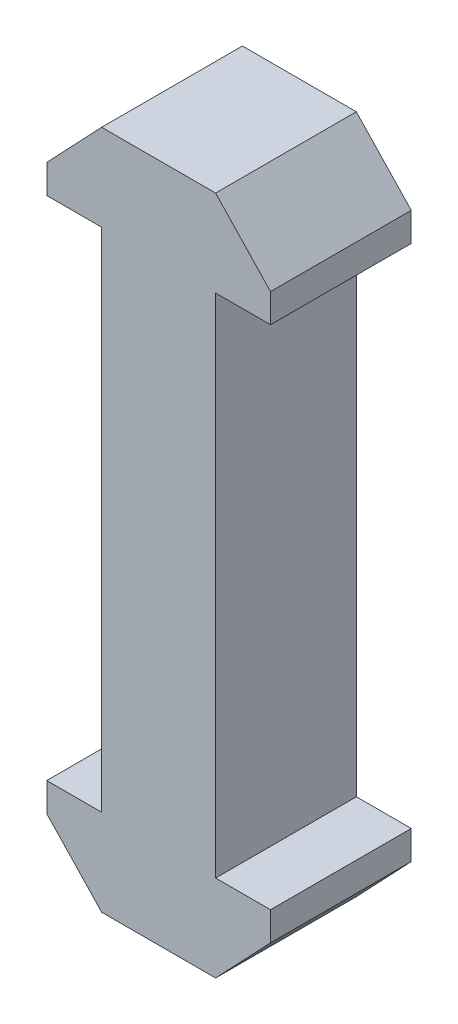
ISO-10303-21;
HEADER;
FILE_DESCRIPTION(('STEP AP214'),'2;1');
FILE_NAME('part.step','',(''),(''),'','','');
FILE_SCHEMA(('AUTOMOTIVE_DESIGN { 1 0 10303 214 1 1 1 1 }'));
ENDSEC;
DATA;
#1=APPLICATION_CONTEXT('core data for automotive mechanical design processes');
#2=APPLICATION_PROTOCOL_DEFINITION('international standard','automotive_design',2000,#1);
#3=PRODUCT_CONTEXT('',#1,'mechanical');
#4=PRODUCT('Part','Part','',(#3));
#5=PRODUCT_RELATED_PRODUCT_CATEGORY('part','',(#4));
#6=PRODUCT_DEFINITION_FORMATION('','',#4);
#7=PRODUCT_DEFINITION_CONTEXT('part definition',#1,'design');
#8=PRODUCT_DEFINITION('design','',#6,#7);
#9=PRODUCT_DEFINITION_SHAPE('','',#8);
#10=(LENGTH_UNIT() NAMED_UNIT(*) SI_UNIT(.MILLI.,.METRE.));
#11=(NAMED_UNIT(*) PLANE_ANGLE_UNIT() SI_UNIT($,.RADIAN.));
#12=(NAMED_UNIT(*) SI_UNIT($,.STERADIAN.) SOLID_ANGLE_UNIT());
#13=UNCERTAINTY_MEASURE_WITH_UNIT(LENGTH_MEASURE(1.E-05),#10,'distance_accuracy_value','');
#14=(GEOMETRIC_REPRESENTATION_CONTEXT(3) GLOBAL_UNCERTAINTY_ASSIGNED_CONTEXT((#13)) GLOBAL_UNIT_ASSIGNED_CONTEXT((#10,
#11,#12)) REPRESENTATION_CONTEXT('',''));
#15=CARTESIAN_POINT('',(0.,0.,0.));
#16=DIRECTION('',(0.,0.,1.));
#17=DIRECTION('',(1.,0.,0.));
#18=AXIS2_PLACEMENT_3D('',#15,#16,#17);
#19=CARTESIAN_POINT('',(-7.95,0.,5.));
#20=DIRECTION('',(-1.,0.,0.));
#21=DIRECTION('',(0.,-1.,0.));
#22=AXIS2_PLACEMENT_3D('',#19,#20,#21);
#23=PLANE('',#22);
#24=DIRECTION('',(0.,1.,0.));
#25=VECTOR('',#24,1.);
#26=CARTESIAN_POINT('',(-7.95,0.,-5.));
#27=LINE('',#26,#25);
#28=CARTESIAN_POINT('',(-7.95,-2.04,-5.));
#29=VERTEX_POINT('',#28);
#30=CARTESIAN_POINT('',(-7.95,0.,-5.));
#31=VERTEX_POINT('',#30);
#32=EDGE_CURVE('E183',#29,#31,#27,.T.);
#33=ORIENTED_EDGE('',*,*,#32,.F.);
#34=DIRECTION('',(0.,0.,-1.));
#35=VECTOR('',#34,1.);
#36=CARTESIAN_POINT('',(-7.95,-2.04,5.));
#37=LINE('',#36,#35);
#38=CARTESIAN_POINT('',(-7.95,-2.04,5.));
#39=VERTEX_POINT('',#38);
#40=EDGE_CURVE('E11',#39,#29,#37,.T.);
#41=ORIENTED_EDGE('',*,*,#40,.F.);
#42=DIRECTION('',(0.,1.,0.));
#43=VECTOR('',#42,1.);
#44=CARTESIAN_POINT('',(-7.95,0.,5.));
#45=LINE('',#44,#43);
#46=CARTESIAN_POINT('',(-7.95,0.,5.));
#47=VERTEX_POINT('',#46);
#48=EDGE_CURVE('E271',#39,#47,#45,.T.);
#49=ORIENTED_EDGE('',*,*,#48,.T.);
#50=DIRECTION('',(0.,0.,-1.));
#51=VECTOR('',#50,1.);
#52=CARTESIAN_POINT('',(-7.95,0.,5.));
#53=LINE('',#52,#51);
#54=EDGE_CURVE('E55',#47,#31,#53,.T.);
#55=ORIENTED_EDGE('',*,*,#54,.T.);
#56=EDGE_LOOP('',(#33,#41,#49,#55));
#57=FACE_BOUND('',#56,.T.);
#58=ADVANCED_FACE('F39',(#57),#23,.T.);
#59=CARTESIAN_POINT('',(-5.20217481392665,-4.93600140143796,5.));
#60=DIRECTION('',(-0.725421588273713,-0.688304815664138,0.));
#61=DIRECTION('',(0.688304815664138,-0.725421588273713,0.));
#62=AXIS2_PLACEMENT_3D('',#59,#60,#61);
#63=PLANE('',#62);
#64=DIRECTION('',(-0.688304815664138,0.725421588273713,0.));
#65=VECTOR('',#64,1.);
#66=CARTESIAN_POINT('',(-5.20217481392665,-4.93600140143796,-5.));
#67=LINE('',#66,#65);
#68=CARTESIAN_POINT('',(-4.048,-6.15241498392368,-5.));
#69=VERTEX_POINT('',#68);
#70=EDGE_CURVE('E185',#69,#29,#67,.T.);
#71=ORIENTED_EDGE('',*,*,#70,.F.);
#72=DIRECTION('',(0.,0.,-1.));
#73=VECTOR('',#72,1.);
#74=CARTESIAN_POINT('',(-4.048,-6.15241498392368,5.));
#75=LINE('',#74,#73);
#76=CARTESIAN_POINT('',(-4.048,-6.15241498392368,5.));
#77=VERTEX_POINT('',#76);
#78=EDGE_CURVE('E47',#77,#69,#75,.T.);
#79=ORIENTED_EDGE('',*,*,#78,.F.);
#80=DIRECTION('',(-0.688304815664138,0.725421588273713,0.));
#81=VECTOR('',#80,1.);
#82=CARTESIAN_POINT('',(-5.20217481392665,-4.93600140143796,5.));
#83=LINE('',#82,#81);
#84=EDGE_CURVE('E267',#77,#39,#83,.T.);
#85=ORIENTED_EDGE('',*,*,#84,.T.);
#86=ORIENTED_EDGE('',*,*,#40,.T.);
#87=EDGE_LOOP('',(#71,#79,#85,#86));
#88=FACE_BOUND('',#87,.T.);
#89=ADVANCED_FACE('F255',(#88),#63,.T.);
#90=CARTESIAN_POINT('',(0.,-6.15241498392368,5.));
#91=DIRECTION('',(0.,-1.,0.));
#92=DIRECTION('',(1.,0.,0.));
#93=AXIS2_PLACEMENT_3D('',#90,#91,#92);
#94=PLANE('',#93);
#95=DIRECTION('',(-1.,0.,0.));
#96=VECTOR('',#95,1.);
#97=CARTESIAN_POINT('',(0.,-6.15241498392368,-5.));
#98=LINE('',#97,#96);
#99=CARTESIAN_POINT('',(4.048,-6.15241498392368,-5.));
#100=VERTEX_POINT('',#99);
#101=EDGE_CURVE('E188',#100,#69,#98,.T.);
#102=ORIENTED_EDGE('',*,*,#101,.F.);
#103=DIRECTION('',(0.,0.,-1.));
#104=VECTOR('',#103,1.);
#105=CARTESIAN_POINT('',(4.048,-6.15241498392368,5.));
#106=LINE('',#105,#104);
#107=CARTESIAN_POINT('',(4.048,-6.15241498392368,5.));
#108=VERTEX_POINT('',#107);
#109=EDGE_CURVE('E244',#108,#100,#106,.T.);
#110=ORIENTED_EDGE('',*,*,#109,.F.);
#111=DIRECTION('',(-1.,0.,0.));
#112=VECTOR('',#111,1.);
#113=CARTESIAN_POINT('',(0.,-6.15241498392368,5.));
#114=LINE('',#113,#112);
#115=EDGE_CURVE('E251',#108,#77,#114,.T.);
#116=ORIENTED_EDGE('',*,*,#115,.T.);
#117=ORIENTED_EDGE('',*,*,#78,.T.);
#118=EDGE_LOOP('',(#102,#110,#116,#117));
#119=FACE_BOUND('',#118,.T.);
#120=ADVANCED_FACE('F249',(#119),#94,.T.);
#121=CARTESIAN_POINT('',(5.20217481392665,-4.93600140143796,5.));
#122=DIRECTION('',(0.725421588273714,-0.688304815664138,0.));
#123=DIRECTION('',(0.688304815664138,0.725421588273714,0.));
#124=AXIS2_PLACEMENT_3D('',#121,#122,#123);
#125=PLANE('',#124);
#126=DIRECTION('',(-0.688304815664138,-0.725421588273714,0.));
#127=VECTOR('',#126,1.);
#128=CARTESIAN_POINT('',(5.20217481392665,-4.93600140143796,-5.));
#129=LINE('',#128,#127);
#130=CARTESIAN_POINT('',(7.95,-2.04,-5.));
#131=VERTEX_POINT('',#130);
#132=EDGE_CURVE('E191',#131,#100,#129,.T.);
#133=ORIENTED_EDGE('',*,*,#132,.F.);
#134=DIRECTION('',(0.,0.,-1.));
#135=VECTOR('',#134,1.);
#136=CARTESIAN_POINT('',(7.95,-2.04,5.));
#137=LINE('',#136,#135);
#138=CARTESIAN_POINT('',(7.95,-2.04,5.));
#139=VERTEX_POINT('',#138);
#140=EDGE_CURVE('E242',#139,#131,#137,.T.);
#141=ORIENTED_EDGE('',*,*,#140,.F.);
#142=DIRECTION('',(-0.688304815664138,-0.725421588273714,0.));
#143=VECTOR('',#142,1.);
#144=CARTESIAN_POINT('',(5.20217481392665,-4.93600140143796,5.));
#145=LINE('',#144,#143);
#146=EDGE_CURVE('E264',#139,#108,#145,.T.);
#147=ORIENTED_EDGE('',*,*,#146,.T.);
#148=ORIENTED_EDGE('',*,*,#109,.T.);
#149=EDGE_LOOP('',(#133,#141,#147,#148));
#150=FACE_BOUND('',#149,.T.);
#151=ADVANCED_FACE('F261',(#150),#125,.T.);
#152=CARTESIAN_POINT('',(7.95,0.,5.));
#153=DIRECTION('',(1.,0.,0.));
#154=DIRECTION('',(0.,1.,0.));
#155=AXIS2_PLACEMENT_3D('',#152,#153,#154);
#156=PLANE('',#155);
#157=DIRECTION('',(0.,-1.,0.));
#158=VECTOR('',#157,1.);
#159=CARTESIAN_POINT('',(7.95,0.,-5.));
#160=LINE('',#159,#158);
#161=CARTESIAN_POINT('',(7.95,0.,-5.));
#162=VERTEX_POINT('',#161);
#163=EDGE_CURVE('E194',#162,#131,#160,.T.);
#164=ORIENTED_EDGE('',*,*,#163,.F.);
#165=DIRECTION('',(0.,0.,-1.));
#166=VECTOR('',#165,1.);
#167=CARTESIAN_POINT('',(7.95,0.,5.));
#168=LINE('',#167,#166);
#169=CARTESIAN_POINT('',(7.95,0.,5.));
#170=VERTEX_POINT('',#169);
#171=EDGE_CURVE('E240',#170,#162,#168,.T.);
#172=ORIENTED_EDGE('',*,*,#171,.F.);
#173=DIRECTION('',(0.,-1.,0.));
#174=VECTOR('',#173,1.);
#175=CARTESIAN_POINT('',(7.95,0.,5.));
#176=LINE('',#175,#174);
#177=EDGE_CURVE('E269',#170,#139,#176,.T.);
#178=ORIENTED_EDGE('',*,*,#177,.T.);
#179=ORIENTED_EDGE('',*,*,#140,.T.);
#180=EDGE_LOOP('',(#164,#172,#178,#179));
#181=FACE_BOUND('',#180,.T.);
#182=ADVANCED_FACE('F309',(#181),#156,.T.);
#183=CARTESIAN_POINT('',(0.,0.,5.));
#184=DIRECTION('',(0.,1.,0.));
#185=DIRECTION('',(-1.,0.,0.));
#186=AXIS2_PLACEMENT_3D('',#183,#184,#185);
#187=PLANE('',#186);
#188=DIRECTION('',(1.,0.,0.));
#189=VECTOR('',#188,1.);
#190=CARTESIAN_POINT('',(0.,0.,-5.));
#191=LINE('',#190,#189);
#192=CARTESIAN_POINT('',(4.05,0.,-5.));
#193=VERTEX_POINT('',#192);
#194=EDGE_CURVE('E197',#193,#162,#191,.T.);
#195=ORIENTED_EDGE('',*,*,#194,.F.);
#196=DIRECTION('',(0.,0.,-1.));
#197=VECTOR('',#196,1.);
#198=CARTESIAN_POINT('',(4.05,0.,5.));
#199=LINE('',#198,#197);
#200=CARTESIAN_POINT('',(4.05,0.,5.));
#201=VERTEX_POINT('',#200);
#202=EDGE_CURVE('E238',#201,#193,#199,.T.);
#203=ORIENTED_EDGE('',*,*,#202,.F.);
#204=DIRECTION('',(1.,0.,0.));
#205=VECTOR('',#204,1.);
#206=CARTESIAN_POINT('',(0.,0.,5.));
#207=LINE('',#206,#205);
#208=EDGE_CURVE('E179',#201,#170,#207,.T.);
#209=ORIENTED_EDGE('',*,*,#208,.T.);
#210=ORIENTED_EDGE('',*,*,#171,.T.);
#211=EDGE_LOOP('',(#195,#203,#209,#210));
#212=FACE_BOUND('',#211,.T.);
#213=ADVANCED_FACE('F299',(#212),#187,.T.);
#214=CARTESIAN_POINT('',(4.05,0.,5.));
#215=DIRECTION('',(-1.,0.,0.));
#216=DIRECTION('',(0.,0.,1.));
#217=AXIS2_PLACEMENT_3D('',#214,#215,#216);
#218=PLANE('',#217);
#219=DIRECTION('',(0.,1.,0.));
#220=VECTOR('',#219,1.);
#221=CARTESIAN_POINT('',(4.05,0.,-5.));
#222=LINE('',#221,#220);
#223=CARTESIAN_POINT('',(4.05,36.,-5.));
#224=VERTEX_POINT('',#223);
#225=EDGE_CURVE('E200',#193,#224,#222,.T.);
#226=ORIENTED_EDGE('',*,*,#225,.T.);
#227=DIRECTION('',(0.,0.,-1.));
#228=VECTOR('',#227,1.);
#229=CARTESIAN_POINT('',(4.05,36.,5.));
#230=LINE('',#229,#228);
#231=CARTESIAN_POINT('',(4.05,36.,5.));
#232=VERTEX_POINT('',#231);
#233=EDGE_CURVE('E235',#232,#224,#230,.T.);
#234=ORIENTED_EDGE('',*,*,#233,.F.);
#235=DIRECTION('',(0.,1.,0.));
#236=VECTOR('',#235,1.);
#237=CARTESIAN_POINT('',(4.05,0.,5.));
#238=LINE('',#237,#236);
#239=EDGE_CURVE('E277',#201,#232,#238,.T.);
#240=ORIENTED_EDGE('',*,*,#239,.F.);
#241=ORIENTED_EDGE('',*,*,#202,.T.);
#242=EDGE_LOOP('',(#226,#234,#240,#241));
#243=FACE_BOUND('',#242,.T.);
#244=ADVANCED_FACE('F308',(#243),#218,.F.);
#245=CARTESIAN_POINT('',(0.,36.,5.));
#246=DIRECTION('',(0.,1.,0.));
#247=DIRECTION('',(-1.,0.,0.));
#248=AXIS2_PLACEMENT_3D('',#245,#246,#247);
#249=PLANE('',#248);
#250=DIRECTION('',(1.,0.,0.));
#251=VECTOR('',#250,1.);
#252=CARTESIAN_POINT('',(0.,36.,-5.));
#253=LINE('',#252,#251);
#254=CARTESIAN_POINT('',(7.95,36.,-5.));
#255=VERTEX_POINT('',#254);
#256=EDGE_CURVE('E203',#224,#255,#253,.T.);
#257=ORIENTED_EDGE('',*,*,#256,.T.);
#258=DIRECTION('',(0.,0.,-1.));
#259=VECTOR('',#258,1.);
#260=CARTESIAN_POINT('',(7.95,36.,5.));
#261=LINE('',#260,#259);
#262=CARTESIAN_POINT('',(7.95,36.,5.));
#263=VERTEX_POINT('',#262);
#264=EDGE_CURVE('E232',#263,#255,#261,.T.);
#265=ORIENTED_EDGE('',*,*,#264,.F.);
#266=DIRECTION('',(1.,0.,0.));
#267=VECTOR('',#266,1.);
#268=CARTESIAN_POINT('',(0.,36.,5.));
#269=LINE('',#268,#267);
#270=EDGE_CURVE('E165',#232,#263,#269,.T.);
#271=ORIENTED_EDGE('',*,*,#270,.F.);
#272=ORIENTED_EDGE('',*,*,#233,.T.);
#273=EDGE_LOOP('',(#257,#265,#271,#272));
#274=FACE_BOUND('',#273,.T.);
#275=ADVANCED_FACE('F327',(#274),#249,.F.);
#276=CARTESIAN_POINT('',(7.95000000000006,0.,5.));
#277=DIRECTION('',(-1.,0.,0.));
#278=DIRECTION('',(0.,-1.,0.));
#279=AXIS2_PLACEMENT_3D('',#276,#277,#278);
#280=PLANE('',#279);
#281=DIRECTION('',(0.,1.,0.));
#282=VECTOR('',#281,1.);
#283=CARTESIAN_POINT('',(7.95000000000006,0.,-5.));
#284=LINE('',#283,#282);
#285=CARTESIAN_POINT('',(7.95,38.04,-5.));
#286=VERTEX_POINT('',#285);
#287=EDGE_CURVE('E205',#255,#286,#284,.T.);
#288=ORIENTED_EDGE('',*,*,#287,.T.);
#289=DIRECTION('',(0.,0.,-1.));
#290=VECTOR('',#289,1.);
#291=CARTESIAN_POINT('',(7.95,38.04,5.));
#292=LINE('',#291,#290);
#293=CARTESIAN_POINT('',(7.95,38.04,5.));
#294=VERTEX_POINT('',#293);
#295=EDGE_CURVE('E229',#294,#286,#292,.T.);
#296=ORIENTED_EDGE('',*,*,#295,.F.);
#297=DIRECTION('',(0.,1.,0.));
#298=VECTOR('',#297,1.);
#299=CARTESIAN_POINT('',(7.95000000000006,0.,5.));
#300=LINE('',#299,#298);
#301=EDGE_CURVE('E279',#263,#294,#300,.T.);
#302=ORIENTED_EDGE('',*,*,#301,.F.);
#303=ORIENTED_EDGE('',*,*,#264,.T.);
#304=EDGE_LOOP('',(#288,#296,#302,#303));
#305=FACE_BOUND('',#304,.T.);
#306=ADVANCED_FACE('F329',(#305),#280,.F.);
#307=CARTESIAN_POINT('',(23.1773770273655,21.99148809503,5.));
#308=DIRECTION('',(-0.725421588273713,-0.688304815664139,0.));
#309=DIRECTION('',(0.688304815664139,-0.725421588273713,0.));
#310=AXIS2_PLACEMENT_3D('',#307,#308,#309);
#311=PLANE('',#310);
#312=DIRECTION('',(-0.688304815664139,0.725421588273713,0.));
#313=VECTOR('',#312,1.);
#314=CARTESIAN_POINT('',(23.1773770273655,21.99148809503,-5.));
#315=LINE('',#314,#313);
#316=CARTESIAN_POINT('',(4.04799999999999,42.1524149839237,-5.));
#317=VERTEX_POINT('',#316);
#318=EDGE_CURVE('E207',#286,#317,#315,.T.);
#319=ORIENTED_EDGE('',*,*,#318,.T.);
#320=DIRECTION('',(0.,0.,-1.));
#321=VECTOR('',#320,1.);
#322=CARTESIAN_POINT('',(4.04799999999999,42.1524149839237,5.));
#323=LINE('',#322,#321);
#324=CARTESIAN_POINT('',(4.04799999999999,42.1524149839237,5.));
#325=VERTEX_POINT('',#324);
#326=EDGE_CURVE('E226',#325,#317,#323,.T.);
#327=ORIENTED_EDGE('',*,*,#326,.F.);
#328=DIRECTION('',(-0.688304815664139,0.725421588273713,0.));
#329=VECTOR('',#328,1.);
#330=CARTESIAN_POINT('',(23.1773770273655,21.99148809503,5.));
#331=LINE('',#330,#329);
#332=EDGE_CURVE('E281',#294,#325,#331,.T.);
#333=ORIENTED_EDGE('',*,*,#332,.F.);
#334=ORIENTED_EDGE('',*,*,#295,.T.);
#335=EDGE_LOOP('',(#319,#327,#333,#334));
#336=FACE_BOUND('',#335,.T.);
#337=ADVANCED_FACE('F332',(#336),#311,.F.);
#338=CARTESIAN_POINT('',(0.,42.1524149839237,5.));
#339=DIRECTION('',(0.,-1.,0.));
#340=DIRECTION('',(1.,0.,0.));
#341=AXIS2_PLACEMENT_3D('',#338,#339,#340);
#342=PLANE('',#341);
#343=DIRECTION('',(-1.,0.,0.));
#344=VECTOR('',#343,1.);
#345=CARTESIAN_POINT('',(0.,42.1524149839237,-5.));
#346=LINE('',#345,#344);
#347=CARTESIAN_POINT('',(-4.04800000000001,42.1524149839237,-5.));
#348=VERTEX_POINT('',#347);
#349=EDGE_CURVE('E209',#317,#348,#346,.T.);
#350=ORIENTED_EDGE('',*,*,#349,.T.);
#351=DIRECTION('',(0.,0.,-1.));
#352=VECTOR('',#351,1.);
#353=CARTESIAN_POINT('',(-4.04800000000001,42.1524149839237,5.));
#354=LINE('',#353,#352);
#355=CARTESIAN_POINT('',(-4.04800000000001,42.1524149839237,5.));
#356=VERTEX_POINT('',#355);
#357=EDGE_CURVE('E223',#356,#348,#354,.T.);
#358=ORIENTED_EDGE('',*,*,#357,.F.);
#359=DIRECTION('',(-1.,0.,0.));
#360=VECTOR('',#359,1.);
#361=CARTESIAN_POINT('',(0.,42.1524149839237,5.));
#362=LINE('',#361,#360);
#363=EDGE_CURVE('E283',#325,#356,#362,.T.);
#364=ORIENTED_EDGE('',*,*,#363,.F.);
#365=ORIENTED_EDGE('',*,*,#326,.T.);
#366=EDGE_LOOP('',(#350,#358,#364,#365));
#367=FACE_BOUND('',#366,.T.);
#368=ADVANCED_FACE('F336',(#367),#342,.F.);
#369=CARTESIAN_POINT('',(-23.1773770273655,21.9914880950299,5.));
#370=DIRECTION('',(0.725421588273714,-0.688304815664137,0.));
#371=DIRECTION('',(0.688304815664137,0.725421588273714,0.));
#372=AXIS2_PLACEMENT_3D('',#369,#370,#371);
#373=PLANE('',#372);
#374=DIRECTION('',(-0.688304815664137,-0.725421588273714,0.));
#375=VECTOR('',#374,1.);
#376=CARTESIAN_POINT('',(-23.1773770273655,21.9914880950299,-5.));
#377=LINE('',#376,#375);
#378=CARTESIAN_POINT('',(-7.95000000000001,38.04,-5.));
#379=VERTEX_POINT('',#378);
#380=EDGE_CURVE('E211',#348,#379,#377,.T.);
#381=ORIENTED_EDGE('',*,*,#380,.T.);
#382=DIRECTION('',(0.,0.,-1.));
#383=VECTOR('',#382,1.);
#384=CARTESIAN_POINT('',(-7.95000000000001,38.04,5.));
#385=LINE('',#384,#383);
#386=CARTESIAN_POINT('',(-7.95000000000001,38.04,5.));
#387=VERTEX_POINT('',#386);
#388=EDGE_CURVE('E220',#387,#379,#385,.T.);
#389=ORIENTED_EDGE('',*,*,#388,.F.);
#390=DIRECTION('',(-0.688304815664137,-0.725421588273714,0.));
#391=VECTOR('',#390,1.);
#392=CARTESIAN_POINT('',(-23.1773770273655,21.9914880950299,5.));
#393=LINE('',#392,#391);
#394=EDGE_CURVE('E284',#356,#387,#393,.T.);
#395=ORIENTED_EDGE('',*,*,#394,.F.);
#396=ORIENTED_EDGE('',*,*,#357,.T.);
#397=EDGE_LOOP('',(#381,#389,#395,#396));
#398=FACE_BOUND('',#397,.T.);
#399=ADVANCED_FACE('F290',(#398),#373,.F.);
#400=CARTESIAN_POINT('',(-7.95,0.,5.));
#401=DIRECTION('',(1.,0.,0.));
#402=DIRECTION('',(0.,0.,-1.));
#403=AXIS2_PLACEMENT_3D('',#400,#401,#402);
#404=PLANE('',#403);
#405=DIRECTION('',(0.,-1.,0.));
#406=VECTOR('',#405,1.);
#407=CARTESIAN_POINT('',(-7.95,0.,-5.));
#408=LINE('',#407,#406);
#409=CARTESIAN_POINT('',(-7.95,36.,-5.));
#410=VERTEX_POINT('',#409);
#411=EDGE_CURVE('E213',#379,#410,#408,.T.);
#412=ORIENTED_EDGE('',*,*,#411,.T.);
#413=DIRECTION('',(0.,0.,-1.));
#414=VECTOR('',#413,1.);
#415=CARTESIAN_POINT('',(-7.95,36.,5.));
#416=LINE('',#415,#414);
#417=CARTESIAN_POINT('',(-7.95,36.,5.));
#418=VERTEX_POINT('',#417);
#419=EDGE_CURVE('E173',#418,#410,#416,.T.);
#420=ORIENTED_EDGE('',*,*,#419,.F.);
#421=DIRECTION('',(0.,-1.,0.));
#422=VECTOR('',#421,1.);
#423=CARTESIAN_POINT('',(-7.95,0.,5.));
#424=LINE('',#423,#422);
#425=EDGE_CURVE('E160',#387,#418,#424,.T.);
#426=ORIENTED_EDGE('',*,*,#425,.F.);
#427=ORIENTED_EDGE('',*,*,#388,.T.);
#428=EDGE_LOOP('',(#412,#420,#426,#427));
#429=FACE_BOUND('',#428,.T.);
#430=ADVANCED_FACE('F294',(#429),#404,.F.);
#431=CARTESIAN_POINT('',(-4.05,36.,-5.));
#432=VERTEX_POINT('',#431);
#433=EDGE_CURVE('E170',#410,#432,#253,.T.);
#434=ORIENTED_EDGE('',*,*,#433,.T.);
#435=DIRECTION('',(0.,0.,-1.));
#436=VECTOR('',#435,1.);
#437=CARTESIAN_POINT('',(-4.05,36.,5.));
#438=LINE('',#437,#436);
#439=CARTESIAN_POINT('',(-4.05,36.,5.));
#440=VERTEX_POINT('',#439);
#441=EDGE_CURVE('E167',#440,#432,#438,.T.);
#442=ORIENTED_EDGE('',*,*,#441,.F.);
#443=EDGE_CURVE('E153',#418,#440,#269,.T.);
#444=ORIENTED_EDGE('',*,*,#443,.F.);
#445=ORIENTED_EDGE('',*,*,#419,.T.);
#446=EDGE_LOOP('',(#434,#442,#444,#445));
#447=FACE_BOUND('',#446,.T.);
#448=ADVANCED_FACE('F168',(#447),#249,.F.);
#449=CARTESIAN_POINT('',(-4.05,0.,5.));
#450=DIRECTION('',(-1.,0.,0.));
#451=DIRECTION('',(0.,0.,1.));
#452=AXIS2_PLACEMENT_3D('',#449,#450,#451);
#453=PLANE('',#452);
#454=DIRECTION('',(0.,1.,0.));
#455=VECTOR('',#454,1.);
#456=CARTESIAN_POINT('',(-4.05,0.,-5.));
#457=LINE('',#456,#455);
#458=CARTESIAN_POINT('',(-4.05,0.,-5.));
#459=VERTEX_POINT('',#458);
#460=EDGE_CURVE('E215',#459,#432,#457,.T.);
#461=ORIENTED_EDGE('',*,*,#460,.F.);
#462=DIRECTION('',(0.,0.,-1.));
#463=VECTOR('',#462,1.);
#464=CARTESIAN_POINT('',(-4.05,0.,5.));
#465=LINE('',#464,#463);
#466=CARTESIAN_POINT('',(-4.05,0.,5.));
#467=VERTEX_POINT('',#466);
#468=EDGE_CURVE('E104',#467,#459,#465,.T.);
#469=ORIENTED_EDGE('',*,*,#468,.F.);
#470=DIRECTION('',(0.,1.,0.));
#471=VECTOR('',#470,1.);
#472=CARTESIAN_POINT('',(-4.05,0.,5.));
#473=LINE('',#472,#471);
#474=EDGE_CURVE('E158',#467,#440,#473,.T.);
#475=ORIENTED_EDGE('',*,*,#474,.T.);
#476=ORIENTED_EDGE('',*,*,#441,.T.);
#477=EDGE_LOOP('',(#461,#469,#475,#476));
#478=FACE_BOUND('',#477,.T.);
#479=ADVANCED_FACE('F175',(#478),#453,.T.);
#480=EDGE_CURVE('E201',#31,#459,#191,.T.);
#481=ORIENTED_EDGE('',*,*,#480,.F.);
#482=ORIENTED_EDGE('',*,*,#54,.F.);
#483=EDGE_CURVE('E176',#47,#467,#207,.T.);
#484=ORIENTED_EDGE('',*,*,#483,.T.);
#485=ORIENTED_EDGE('',*,*,#468,.T.);
#486=EDGE_LOOP('',(#481,#482,#484,#485));
#487=FACE_BOUND('',#486,.T.);
#488=ADVANCED_FACE('F296',(#487),#187,.T.);
#489=CARTESIAN_POINT('',(0.,0.,5.));
#490=DIRECTION('',(0.,0.,1.));
#491=DIRECTION('',(1.,0.,0.));
#492=AXIS2_PLACEMENT_3D('',#489,#490,#491);
#493=PLANE('',#492);
#494=ORIENTED_EDGE('',*,*,#48,.F.);
#495=ORIENTED_EDGE('',*,*,#84,.F.);
#496=ORIENTED_EDGE('',*,*,#115,.F.);
#497=ORIENTED_EDGE('',*,*,#146,.F.);
#498=ORIENTED_EDGE('',*,*,#177,.F.);
#499=ORIENTED_EDGE('',*,*,#208,.F.);
#500=ORIENTED_EDGE('',*,*,#239,.T.);
#501=ORIENTED_EDGE('',*,*,#270,.T.);
#502=ORIENTED_EDGE('',*,*,#301,.T.);
#503=ORIENTED_EDGE('',*,*,#332,.T.);
#504=ORIENTED_EDGE('',*,*,#363,.T.);
#505=ORIENTED_EDGE('',*,*,#394,.T.);
#506=ORIENTED_EDGE('',*,*,#425,.T.);
#507=ORIENTED_EDGE('',*,*,#443,.T.);
#508=ORIENTED_EDGE('',*,*,#474,.F.);
#509=ORIENTED_EDGE('',*,*,#483,.F.);
#510=EDGE_LOOP('',(#494,#495,#496,#497,#498,#499,#500,#501,#502,#503,#504,#505,#506,#507,#508,#509));
#511=FACE_BOUND('',#510,.T.);
#512=ADVANCED_FACE('F155',(#511),#493,.T.);
#513=CARTESIAN_POINT('',(0.,0.,-5.));
#514=DIRECTION('',(0.,0.,1.));
#515=DIRECTION('',(1.,0.,0.));
#516=AXIS2_PLACEMENT_3D('',#513,#514,#515);
#517=PLANE('',#516);
#518=ORIENTED_EDGE('',*,*,#32,.T.);
#519=ORIENTED_EDGE('',*,*,#480,.T.);
#520=ORIENTED_EDGE('',*,*,#460,.T.);
#521=ORIENTED_EDGE('',*,*,#433,.F.);
#522=ORIENTED_EDGE('',*,*,#411,.F.);
#523=ORIENTED_EDGE('',*,*,#380,.F.);
#524=ORIENTED_EDGE('',*,*,#349,.F.);
#525=ORIENTED_EDGE('',*,*,#318,.F.);
#526=ORIENTED_EDGE('',*,*,#287,.F.);
#527=ORIENTED_EDGE('',*,*,#256,.F.);
#528=ORIENTED_EDGE('',*,*,#225,.F.);
#529=ORIENTED_EDGE('',*,*,#194,.T.);
#530=ORIENTED_EDGE('',*,*,#163,.T.);
#531=ORIENTED_EDGE('',*,*,#132,.T.);
#532=ORIENTED_EDGE('',*,*,#101,.T.);
#533=ORIENTED_EDGE('',*,*,#70,.T.);
#534=EDGE_LOOP('',(#518,#519,#520,#521,#522,#523,#524,#525,#526,#527,#528,#529,#530,#531,#532,#533));
#535=FACE_BOUND('',#534,.T.);
#536=ADVANCED_FACE('F257',(#535),#517,.F.);
#537=CLOSED_SHELL('',(#58,#89,#120,#151,#182,#213,#244,#275,#306,#337,#368,#399,#430,#448,#479,
#488,#512,#536));
#538=MANIFOLD_SOLID_BREP('B2',#537);
#539=ADVANCED_BREP_SHAPE_REPRESENTATION('',(#18,#538),#14);
#540=SHAPE_DEFINITION_REPRESENTATION(#9,#539);
ENDSEC;
END-ISO-10303-21;
